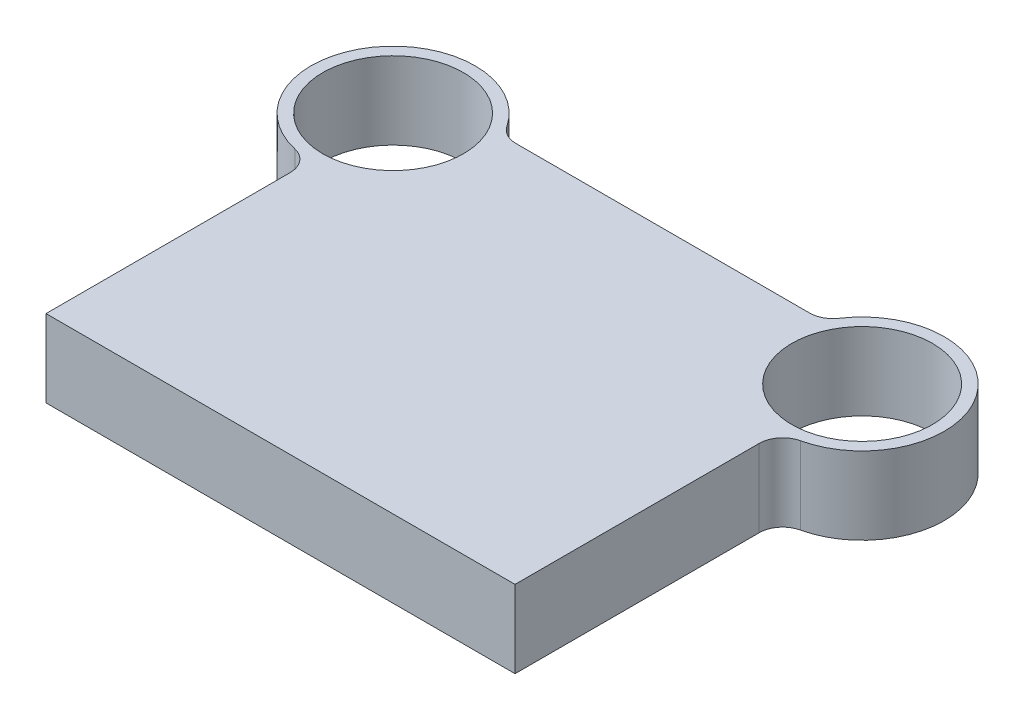
ISO-10303-21;
HEADER;
FILE_DESCRIPTION(('STEP AP214'),'2;1');
FILE_NAME('part.step','',(''),(''),'','','');
FILE_SCHEMA(('AUTOMOTIVE_DESIGN { 1 0 10303 214 1 1 1 1 }'));
ENDSEC;
DATA;
#1=APPLICATION_CONTEXT('core data for automotive mechanical design processes');
#2=APPLICATION_PROTOCOL_DEFINITION('international standard','automotive_design',2000,#1);
#3=PRODUCT_CONTEXT('',#1,'mechanical');
#4=PRODUCT('Part','Part','',(#3));
#5=PRODUCT_RELATED_PRODUCT_CATEGORY('part','',(#4));
#6=PRODUCT_DEFINITION_FORMATION('','',#4);
#7=PRODUCT_DEFINITION_CONTEXT('part definition',#1,'design');
#8=PRODUCT_DEFINITION('design','',#6,#7);
#9=PRODUCT_DEFINITION_SHAPE('','',#8);
#10=(LENGTH_UNIT() NAMED_UNIT(*) SI_UNIT(.MILLI.,.METRE.));
#11=(NAMED_UNIT(*) PLANE_ANGLE_UNIT() SI_UNIT($,.RADIAN.));
#12=(NAMED_UNIT(*) SI_UNIT($,.STERADIAN.) SOLID_ANGLE_UNIT());
#13=UNCERTAINTY_MEASURE_WITH_UNIT(LENGTH_MEASURE(1.E-05),#10,'distance_accuracy_value','');
#14=(GEOMETRIC_REPRESENTATION_CONTEXT(3) GLOBAL_UNCERTAINTY_ASSIGNED_CONTEXT((#13)) GLOBAL_UNIT_ASSIGNED_CONTEXT((#10,
#11,#12)) REPRESENTATION_CONTEXT('',''));
#15=CARTESIAN_POINT('',(0.,0.,0.));
#16=DIRECTION('',(0.,0.,1.));
#17=DIRECTION('',(1.,0.,0.));
#18=AXIS2_PLACEMENT_3D('',#15,#16,#17);
#19=CARTESIAN_POINT('',(-100.,33.,-148.));
#20=DIRECTION('',(0.,1.,0.));
#21=DIRECTION('',(0.,0.,1.));
#22=AXIS2_PLACEMENT_3D('',#19,#20,#21);
#23=PLANE('',#22);
#24=CARTESIAN_POINT('',(-100.,33.,-148.));
#25=DIRECTION('',(0.,1.,0.));
#26=DIRECTION('',(0.,0.,1.));
#27=AXIS2_PLACEMENT_3D('',#24,#25,#26);
#28=CIRCLE('',#27,30.);
#29=CARTESIAN_POINT('',(-100.,33.,-118.));
#30=VERTEX_POINT('',#29);
#31=EDGE_CURVE('E240',#30,#30,#28,.T.);
#32=ORIENTED_EDGE('',*,*,#31,.F.);
#33=EDGE_LOOP('',(#32));
#34=FACE_BOUND('',#33,.T.);
#35=CARTESIAN_POINT('',(-100.,33.,-148.));
#36=DIRECTION('',(0.,1.,0.));
#37=DIRECTION('',(0.,0.,1.));
#38=AXIS2_PLACEMENT_3D('',#35,#36,#37);
#39=CIRCLE('',#38,35.);
#40=CARTESIAN_POINT('',(-70.8982203250916,33.,-167.444444444444));
#41=VERTEX_POINT('',#40);
#42=CARTESIAN_POINT('',(-107.777777777778,33.,-113.875138493475));
#43=VERTEX_POINT('',#42);
#44=EDGE_CURVE('E133',#41,#43,#39,.T.);
#45=ORIENTED_EDGE('',*,*,#44,.T.);
#46=CARTESIAN_POINT('',(-110.,33.,-104.125178063039));
#47=DIRECTION('',(0.,1.,0.));
#48=DIRECTION('',(0.,0.,1.));
#49=AXIS2_PLACEMENT_3D('',#46,#47,#48);
#50=CIRCLE('',#49,10.);
#51=CARTESIAN_POINT('',(-100.,33.,-104.125178063039));
#52=VERTEX_POINT('',#51);
#53=EDGE_CURVE('E11',#43,#52,#50,.F.);
#54=ORIENTED_EDGE('',*,*,#53,.T.);
#55=DIRECTION('',(0.,0.,1.));
#56=VECTOR('',#55,1.);
#57=CARTESIAN_POINT('',(-100.,33.,0.));
#58=LINE('',#57,#56);
#59=CARTESIAN_POINT('',(-100.,33.,0.));
#60=VERTEX_POINT('',#59);
#61=EDGE_CURVE('E106',#52,#60,#58,.T.);
#62=ORIENTED_EDGE('',*,*,#61,.T.);
#63=DIRECTION('',(1.,0.,0.));
#64=VECTOR('',#63,1.);
#65=CARTESIAN_POINT('',(100.,33.,0.));
#66=LINE('',#65,#64);
#67=CARTESIAN_POINT('',(100.,33.,0.));
#68=VERTEX_POINT('',#67);
#69=EDGE_CURVE('E110',#60,#68,#66,.T.);
#70=ORIENTED_EDGE('',*,*,#69,.T.);
#71=DIRECTION('',(0.,0.,-1.));
#72=VECTOR('',#71,1.);
#73=CARTESIAN_POINT('',(100.,33.,0.));
#74=LINE('',#73,#72);
#75=CARTESIAN_POINT('',(100.,33.,-104.125178063039));
#76=VERTEX_POINT('',#75);
#77=EDGE_CURVE('E123',#68,#76,#74,.T.);
#78=ORIENTED_EDGE('',*,*,#77,.T.);
#79=CARTESIAN_POINT('',(110.,33.,-104.125178063039));
#80=DIRECTION('',(0.,1.,0.));
#81=DIRECTION('',(0.,0.,1.));
#82=AXIS2_PLACEMENT_3D('',#79,#80,#81);
#83=CIRCLE('',#82,10.);
#84=CARTESIAN_POINT('',(107.777777777778,33.,-113.875138493475));
#85=VERTEX_POINT('',#84);
#86=EDGE_CURVE('E155',#76,#85,#83,.F.);
#87=ORIENTED_EDGE('',*,*,#86,.T.);
#88=CARTESIAN_POINT('',(100.,33.,-148.));
#89=DIRECTION('',(0.,1.,0.));
#90=DIRECTION('',(0.,0.,-1.));
#91=AXIS2_PLACEMENT_3D('',#88,#89,#90);
#92=CIRCLE('',#91,35.);
#93=CARTESIAN_POINT('',(70.8982203250916,33.,-167.444444444444));
#94=VERTEX_POINT('',#93);
#95=EDGE_CURVE('E229',#85,#94,#92,.T.);
#96=ORIENTED_EDGE('',*,*,#95,.T.);
#97=CARTESIAN_POINT('',(62.5834261322606,33.,-173.));
#98=DIRECTION('',(0.,1.,0.));
#99=DIRECTION('',(0.,0.,1.));
#100=AXIS2_PLACEMENT_3D('',#97,#98,#99);
#101=CIRCLE('',#100,10.);
#102=CARTESIAN_POINT('',(62.5834261322606,33.,-163.));
#103=VERTEX_POINT('',#102);
#104=EDGE_CURVE('E159',#94,#103,#101,.F.);
#105=ORIENTED_EDGE('',*,*,#104,.T.);
#106=DIRECTION('',(-1.,0.,0.));
#107=VECTOR('',#106,1.);
#108=CARTESIAN_POINT('',(68.3772233983162,33.,-163.));
#109=LINE('',#108,#107);
#110=CARTESIAN_POINT('',(-62.5834261322606,33.,-163.));
#111=VERTEX_POINT('',#110);
#112=EDGE_CURVE('E226',#103,#111,#109,.T.);
#113=ORIENTED_EDGE('',*,*,#112,.T.);
#114=CARTESIAN_POINT('',(-62.5834261322606,33.,-173.));
#115=DIRECTION('',(0.,1.,0.));
#116=DIRECTION('',(0.,0.,1.));
#117=AXIS2_PLACEMENT_3D('',#114,#115,#116);
#118=CIRCLE('',#117,10.);
#119=EDGE_CURVE('E163',#111,#41,#118,.F.);
#120=ORIENTED_EDGE('',*,*,#119,.T.);
#121=EDGE_LOOP('',(#45,#54,#62,#70,#78,#87,#96,#105,#113,#120));
#122=FACE_BOUND('',#121,.T.);
#123=CARTESIAN_POINT('',(100.,33.,-148.));
#124=DIRECTION('',(0.,1.,0.));
#125=DIRECTION('',(0.,0.,-1.));
#126=AXIS2_PLACEMENT_3D('',#123,#124,#125);
#127=CIRCLE('',#126,30.);
#128=CARTESIAN_POINT('',(100.,33.,-178.));
#129=VERTEX_POINT('',#128);
#130=EDGE_CURVE('E257',#129,#129,#127,.T.);
#131=ORIENTED_EDGE('',*,*,#130,.F.);
#132=EDGE_LOOP('',(#131));
#133=FACE_BOUND('',#132,.T.);
#134=ADVANCED_FACE('F33',(#34,#122,#133),#23,.T.);
#135=CARTESIAN_POINT('',(-100.,0.,-148.));
#136=DIRECTION('',(0.,1.,0.));
#137=DIRECTION('',(0.,0.,1.));
#138=AXIS2_PLACEMENT_3D('',#135,#136,#137);
#139=PLANE('',#138);
#140=DIRECTION('',(0.,0.,1.));
#141=VECTOR('',#140,1.);
#142=CARTESIAN_POINT('',(-100.,0.,0.));
#143=LINE('',#142,#141);
#144=CARTESIAN_POINT('',(-100.,0.,-104.125178063039));
#145=VERTEX_POINT('',#144);
#146=CARTESIAN_POINT('',(-100.,0.,0.));
#147=VERTEX_POINT('',#146);
#148=EDGE_CURVE('E127',#145,#147,#143,.T.);
#149=ORIENTED_EDGE('',*,*,#148,.F.);
#150=CARTESIAN_POINT('',(-110.,0.,-104.125178063039));
#151=DIRECTION('',(0.,1.,0.));
#152=DIRECTION('',(0.,0.,1.));
#153=AXIS2_PLACEMENT_3D('',#150,#151,#152);
#154=CIRCLE('',#153,10.);
#155=CARTESIAN_POINT('',(-107.777777777778,0.,-113.875138493475));
#156=VERTEX_POINT('',#155);
#157=EDGE_CURVE('E41',#145,#156,#154,.T.);
#158=ORIENTED_EDGE('',*,*,#157,.T.);
#159=CARTESIAN_POINT('',(-100.,0.,-148.));
#160=DIRECTION('',(0.,1.,0.));
#161=DIRECTION('',(0.,0.,1.));
#162=AXIS2_PLACEMENT_3D('',#159,#160,#161);
#163=CIRCLE('',#162,35.);
#164=CARTESIAN_POINT('',(-70.8982203250916,0.,-167.444444444444));
#165=VERTEX_POINT('',#164);
#166=EDGE_CURVE('E114',#165,#156,#163,.T.);
#167=ORIENTED_EDGE('',*,*,#166,.F.);
#168=CARTESIAN_POINT('',(-62.5834261322606,0.,-173.));
#169=DIRECTION('',(0.,1.,0.));
#170=DIRECTION('',(0.,0.,1.));
#171=AXIS2_PLACEMENT_3D('',#168,#169,#170);
#172=CIRCLE('',#171,10.);
#173=CARTESIAN_POINT('',(-62.5834261322606,0.,-163.));
#174=VERTEX_POINT('',#173);
#175=EDGE_CURVE('E161',#165,#174,#172,.T.);
#176=ORIENTED_EDGE('',*,*,#175,.T.);
#177=DIRECTION('',(-1.,0.,0.));
#178=VECTOR('',#177,1.);
#179=CARTESIAN_POINT('',(68.3772233983162,0.,-163.));
#180=LINE('',#179,#178);
#181=CARTESIAN_POINT('',(62.5834261322606,0.,-163.));
#182=VERTEX_POINT('',#181);
#183=EDGE_CURVE('E173',#182,#174,#180,.T.);
#184=ORIENTED_EDGE('',*,*,#183,.F.);
#185=CARTESIAN_POINT('',(62.5834261322606,0.,-173.));
#186=DIRECTION('',(0.,1.,0.));
#187=DIRECTION('',(0.,0.,1.));
#188=AXIS2_PLACEMENT_3D('',#185,#186,#187);
#189=CIRCLE('',#188,10.);
#190=CARTESIAN_POINT('',(70.8982203250916,0.,-167.444444444444));
#191=VERTEX_POINT('',#190);
#192=EDGE_CURVE('E157',#182,#191,#189,.T.);
#193=ORIENTED_EDGE('',*,*,#192,.T.);
#194=CARTESIAN_POINT('',(100.,0.,-148.));
#195=DIRECTION('',(0.,1.,0.));
#196=DIRECTION('',(0.,0.,-1.));
#197=AXIS2_PLACEMENT_3D('',#194,#195,#196);
#198=CIRCLE('',#197,35.);
#199=CARTESIAN_POINT('',(107.777777777778,0.,-113.875138493475));
#200=VERTEX_POINT('',#199);
#201=EDGE_CURVE('E245',#200,#191,#198,.T.);
#202=ORIENTED_EDGE('',*,*,#201,.F.);
#203=CARTESIAN_POINT('',(110.,0.,-104.125178063039));
#204=DIRECTION('',(0.,1.,0.));
#205=DIRECTION('',(0.,0.,1.));
#206=AXIS2_PLACEMENT_3D('',#203,#204,#205);
#207=CIRCLE('',#206,10.);
#208=CARTESIAN_POINT('',(100.,0.,-104.125178063039));
#209=VERTEX_POINT('',#208);
#210=EDGE_CURVE('E153',#200,#209,#207,.T.);
#211=ORIENTED_EDGE('',*,*,#210,.T.);
#212=DIRECTION('',(0.,0.,-1.));
#213=VECTOR('',#212,1.);
#214=CARTESIAN_POINT('',(100.,0.,0.));
#215=LINE('',#214,#213);
#216=CARTESIAN_POINT('',(100.,0.,0.));
#217=VERTEX_POINT('',#216);
#218=EDGE_CURVE('E242',#217,#209,#215,.T.);
#219=ORIENTED_EDGE('',*,*,#218,.F.);
#220=DIRECTION('',(1.,0.,0.));
#221=VECTOR('',#220,1.);
#222=CARTESIAN_POINT('',(100.,0.,0.));
#223=LINE('',#222,#221);
#224=EDGE_CURVE('E239',#147,#217,#223,.T.);
#225=ORIENTED_EDGE('',*,*,#224,.F.);
#226=EDGE_LOOP('',(#149,#158,#167,#176,#184,#193,#202,#211,#219,#225));
#227=FACE_BOUND('',#226,.T.);
#228=CARTESIAN_POINT('',(-100.,0.,-148.));
#229=DIRECTION('',(0.,1.,0.));
#230=DIRECTION('',(0.,0.,1.));
#231=AXIS2_PLACEMENT_3D('',#228,#229,#230);
#232=CIRCLE('',#231,30.);
#233=CARTESIAN_POINT('',(-100.,0.,-118.));
#234=VERTEX_POINT('',#233);
#235=EDGE_CURVE('E254',#234,#234,#232,.T.);
#236=ORIENTED_EDGE('',*,*,#235,.T.);
#237=EDGE_LOOP('',(#236));
#238=FACE_BOUND('',#237,.T.);
#239=CARTESIAN_POINT('',(100.,0.,-148.));
#240=DIRECTION('',(0.,1.,0.));
#241=DIRECTION('',(0.,0.,-1.));
#242=AXIS2_PLACEMENT_3D('',#239,#240,#241);
#243=CIRCLE('',#242,30.);
#244=CARTESIAN_POINT('',(100.,0.,-178.));
#245=VERTEX_POINT('',#244);
#246=EDGE_CURVE('E260',#245,#245,#243,.T.);
#247=ORIENTED_EDGE('',*,*,#246,.T.);
#248=EDGE_LOOP('',(#247));
#249=FACE_BOUND('',#248,.T.);
#250=ADVANCED_FACE('F167',(#227,#238,#249),#139,.F.);
#251=CARTESIAN_POINT('',(-100.,33.,0.));
#252=DIRECTION('',(1.,0.,0.));
#253=DIRECTION('',(0.,0.,-1.));
#254=AXIS2_PLACEMENT_3D('',#251,#252,#253);
#255=PLANE('',#254);
#256=ORIENTED_EDGE('',*,*,#61,.F.);
#257=DIRECTION('',(0.,1.,0.));
#258=VECTOR('',#257,1.);
#259=CARTESIAN_POINT('',(-100.,0.,-104.125178063039));
#260=LINE('',#259,#258);
#261=EDGE_CURVE('E151',#52,#145,#260,.F.);
#262=ORIENTED_EDGE('',*,*,#261,.T.);
#263=ORIENTED_EDGE('',*,*,#148,.T.);
#264=DIRECTION('',(0.,-1.,0.));
#265=VECTOR('',#264,1.);
#266=CARTESIAN_POINT('',(-100.,33.,0.));
#267=LINE('',#266,#265);
#268=EDGE_CURVE('E119',#60,#147,#267,.T.);
#269=ORIENTED_EDGE('',*,*,#268,.F.);
#270=EDGE_LOOP('',(#256,#262,#263,#269));
#271=FACE_BOUND('',#270,.T.);
#272=ADVANCED_FACE('F125',(#271),#255,.F.);
#273=CARTESIAN_POINT('',(100.,33.,0.));
#274=DIRECTION('',(0.,0.,-1.));
#275=DIRECTION('',(-1.,0.,0.));
#276=AXIS2_PLACEMENT_3D('',#273,#274,#275);
#277=PLANE('',#276);
#278=ORIENTED_EDGE('',*,*,#224,.T.);
#279=DIRECTION('',(0.,-1.,0.));
#280=VECTOR('',#279,1.);
#281=CARTESIAN_POINT('',(100.,33.,0.));
#282=LINE('',#281,#280);
#283=EDGE_CURVE('E121',#68,#217,#282,.T.);
#284=ORIENTED_EDGE('',*,*,#283,.F.);
#285=ORIENTED_EDGE('',*,*,#69,.F.);
#286=ORIENTED_EDGE('',*,*,#268,.T.);
#287=EDGE_LOOP('',(#278,#284,#285,#286));
#288=FACE_BOUND('',#287,.T.);
#289=ADVANCED_FACE('F118',(#288),#277,.F.);
#290=CARTESIAN_POINT('',(100.,33.,0.));
#291=DIRECTION('',(-1.,0.,0.));
#292=DIRECTION('',(0.,0.,1.));
#293=AXIS2_PLACEMENT_3D('',#290,#291,#292);
#294=PLANE('',#293);
#295=ORIENTED_EDGE('',*,*,#218,.T.);
#296=DIRECTION('',(0.,1.,0.));
#297=VECTOR('',#296,1.);
#298=CARTESIAN_POINT('',(100.,33.,-104.125178063039));
#299=LINE('',#298,#297);
#300=EDGE_CURVE('E139',#209,#76,#299,.T.);
#301=ORIENTED_EDGE('',*,*,#300,.T.);
#302=ORIENTED_EDGE('',*,*,#77,.F.);
#303=ORIENTED_EDGE('',*,*,#283,.T.);
#304=EDGE_LOOP('',(#295,#301,#302,#303));
#305=FACE_BOUND('',#304,.T.);
#306=ADVANCED_FACE('F202',(#305),#294,.F.);
#307=CARTESIAN_POINT('',(100.,33.,-148.));
#308=DIRECTION('',(0.,-1.,0.));
#309=DIRECTION('',(0.,0.,-1.));
#310=AXIS2_PLACEMENT_3D('',#307,#308,#309);
#311=CYLINDRICAL_SURFACE('',#310,35.);
#312=ORIENTED_EDGE('',*,*,#95,.F.);
#313=DIRECTION('',(0.,-1.,0.));
#314=VECTOR('',#313,1.);
#315=CARTESIAN_POINT('',(107.777777777778,33.,-113.875138493475));
#316=LINE('',#315,#314);
#317=EDGE_CURVE('E131',#85,#200,#316,.T.);
#318=ORIENTED_EDGE('',*,*,#317,.T.);
#319=ORIENTED_EDGE('',*,*,#201,.T.);
#320=DIRECTION('',(0.,-1.,0.));
#321=VECTOR('',#320,1.);
#322=CARTESIAN_POINT('',(70.8982203250916,33.,-167.444444444444));
#323=LINE('',#322,#321);
#324=EDGE_CURVE('E129',#191,#94,#323,.F.);
#325=ORIENTED_EDGE('',*,*,#324,.T.);
#326=EDGE_LOOP('',(#312,#318,#319,#325));
#327=FACE_BOUND('',#326,.T.);
#328=ADVANCED_FACE('F198',(#327),#311,.T.);
#329=CARTESIAN_POINT('',(68.3772233983162,33.,-163.));
#330=DIRECTION('',(0.,0.,1.));
#331=DIRECTION('',(1.,0.,0.));
#332=AXIS2_PLACEMENT_3D('',#329,#330,#331);
#333=PLANE('',#332);
#334=ORIENTED_EDGE('',*,*,#112,.F.);
#335=DIRECTION('',(0.,1.,0.));
#336=VECTOR('',#335,1.);
#337=CARTESIAN_POINT('',(62.5834261322606,0.,-163.));
#338=LINE('',#337,#336);
#339=EDGE_CURVE('E143',#103,#182,#338,.F.);
#340=ORIENTED_EDGE('',*,*,#339,.T.);
#341=ORIENTED_EDGE('',*,*,#183,.T.);
#342=DIRECTION('',(0.,1.,0.));
#343=VECTOR('',#342,1.);
#344=CARTESIAN_POINT('',(-62.5834261322606,33.,-163.));
#345=LINE('',#344,#343);
#346=EDGE_CURVE('E141',#174,#111,#345,.T.);
#347=ORIENTED_EDGE('',*,*,#346,.T.);
#348=EDGE_LOOP('',(#334,#340,#341,#347));
#349=FACE_BOUND('',#348,.T.);
#350=ADVANCED_FACE('F195',(#349),#333,.F.);
#351=CARTESIAN_POINT('',(-100.,33.,-148.));
#352=DIRECTION('',(0.,-1.,0.));
#353=DIRECTION('',(0.,0.,-1.));
#354=AXIS2_PLACEMENT_3D('',#351,#352,#353);
#355=CYLINDRICAL_SURFACE('',#354,35.);
#356=ORIENTED_EDGE('',*,*,#44,.F.);
#357=DIRECTION('',(0.,-1.,0.));
#358=VECTOR('',#357,1.);
#359=CARTESIAN_POINT('',(-70.8982203250916,33.,-167.444444444444));
#360=LINE('',#359,#358);
#361=EDGE_CURVE('E148',#41,#165,#360,.T.);
#362=ORIENTED_EDGE('',*,*,#361,.T.);
#363=ORIENTED_EDGE('',*,*,#166,.T.);
#364=DIRECTION('',(0.,-1.,0.));
#365=VECTOR('',#364,1.);
#366=CARTESIAN_POINT('',(-107.777777777778,33.,-113.875138493475));
#367=LINE('',#366,#365);
#368=EDGE_CURVE('E146',#156,#43,#367,.F.);
#369=ORIENTED_EDGE('',*,*,#368,.T.);
#370=EDGE_LOOP('',(#356,#362,#363,#369));
#371=FACE_BOUND('',#370,.T.);
#372=ADVANCED_FACE('F171',(#371),#355,.T.);
#373=CARTESIAN_POINT('',(-100.,33.,-148.));
#374=DIRECTION('',(0.,-1.,0.));
#375=DIRECTION('',(0.,0.,-1.));
#376=AXIS2_PLACEMENT_3D('',#373,#374,#375);
#377=CYLINDRICAL_SURFACE('',#376,30.);
#378=ORIENTED_EDGE('',*,*,#31,.T.);
#379=EDGE_LOOP('',(#378));
#380=FACE_BOUND('',#379,.T.);
#381=ORIENTED_EDGE('',*,*,#235,.F.);
#382=EDGE_LOOP('',(#381));
#383=FACE_BOUND('',#382,.T.);
#384=ADVANCED_FACE('F190',(#380,#383),#377,.F.);
#385=CARTESIAN_POINT('',(100.,33.,-148.));
#386=DIRECTION('',(0.,-1.,0.));
#387=DIRECTION('',(0.,0.,-1.));
#388=AXIS2_PLACEMENT_3D('',#385,#386,#387);
#389=CYLINDRICAL_SURFACE('',#388,30.);
#390=ORIENTED_EDGE('',*,*,#130,.T.);
#391=EDGE_LOOP('',(#390));
#392=FACE_BOUND('',#391,.T.);
#393=ORIENTED_EDGE('',*,*,#246,.F.);
#394=EDGE_LOOP('',(#393));
#395=FACE_BOUND('',#394,.T.);
#396=ADVANCED_FACE('F214',(#392,#395),#389,.F.);
#397=CARTESIAN_POINT('',(110.,33.,-104.125178063039));
#398=DIRECTION('',(0.,-1.,0.));
#399=DIRECTION('',(0.,0.,-1.));
#400=AXIS2_PLACEMENT_3D('',#397,#398,#399);
#401=CYLINDRICAL_SURFACE('',#400,10.);
#402=ORIENTED_EDGE('',*,*,#86,.F.);
#403=ORIENTED_EDGE('',*,*,#300,.F.);
#404=ORIENTED_EDGE('',*,*,#210,.F.);
#405=ORIENTED_EDGE('',*,*,#317,.F.);
#406=EDGE_LOOP('',(#402,#403,#404,#405));
#407=FACE_BOUND('',#406,.T.);
#408=ADVANCED_FACE('F211',(#407),#401,.F.);
#409=CARTESIAN_POINT('',(62.5834261322606,33.,-173.));
#410=DIRECTION('',(0.,-1.,0.));
#411=DIRECTION('',(0.,0.,-1.));
#412=AXIS2_PLACEMENT_3D('',#409,#410,#411);
#413=CYLINDRICAL_SURFACE('',#412,10.);
#414=ORIENTED_EDGE('',*,*,#104,.F.);
#415=ORIENTED_EDGE('',*,*,#324,.F.);
#416=ORIENTED_EDGE('',*,*,#192,.F.);
#417=ORIENTED_EDGE('',*,*,#339,.F.);
#418=EDGE_LOOP('',(#414,#415,#416,#417));
#419=FACE_BOUND('',#418,.T.);
#420=ADVANCED_FACE('F179',(#419),#413,.F.);
#421=CARTESIAN_POINT('',(-62.5834261322606,33.,-173.));
#422=DIRECTION('',(0.,-1.,0.));
#423=DIRECTION('',(0.,0.,-1.));
#424=AXIS2_PLACEMENT_3D('',#421,#422,#423);
#425=CYLINDRICAL_SURFACE('',#424,10.);
#426=ORIENTED_EDGE('',*,*,#119,.F.);
#427=ORIENTED_EDGE('',*,*,#346,.F.);
#428=ORIENTED_EDGE('',*,*,#175,.F.);
#429=ORIENTED_EDGE('',*,*,#361,.F.);
#430=EDGE_LOOP('',(#426,#427,#428,#429));
#431=FACE_BOUND('',#430,.T.);
#432=ADVANCED_FACE('F175',(#431),#425,.F.);
#433=CARTESIAN_POINT('',(-110.,33.,-104.125178063039));
#434=DIRECTION('',(0.,-1.,0.));
#435=DIRECTION('',(0.,0.,-1.));
#436=AXIS2_PLACEMENT_3D('',#433,#434,#435);
#437=CYLINDRICAL_SURFACE('',#436,10.);
#438=ORIENTED_EDGE('',*,*,#53,.F.);
#439=ORIENTED_EDGE('',*,*,#368,.F.);
#440=ORIENTED_EDGE('',*,*,#157,.F.);
#441=ORIENTED_EDGE('',*,*,#261,.F.);
#442=EDGE_LOOP('',(#438,#439,#440,#441));
#443=FACE_BOUND('',#442,.T.);
#444=ADVANCED_FACE('F35',(#443),#437,.F.);
#445=CLOSED_SHELL('',(#134,#250,#272,#289,#306,#328,#350,#372,#384,#396,#408,#420,#432,#444));
#446=MANIFOLD_SOLID_BREP('B2',#445);
#447=ADVANCED_BREP_SHAPE_REPRESENTATION('',(#18,#446),#14);
#448=SHAPE_DEFINITION_REPRESENTATION(#9,#447);
ENDSEC;
END-ISO-10303-21;
